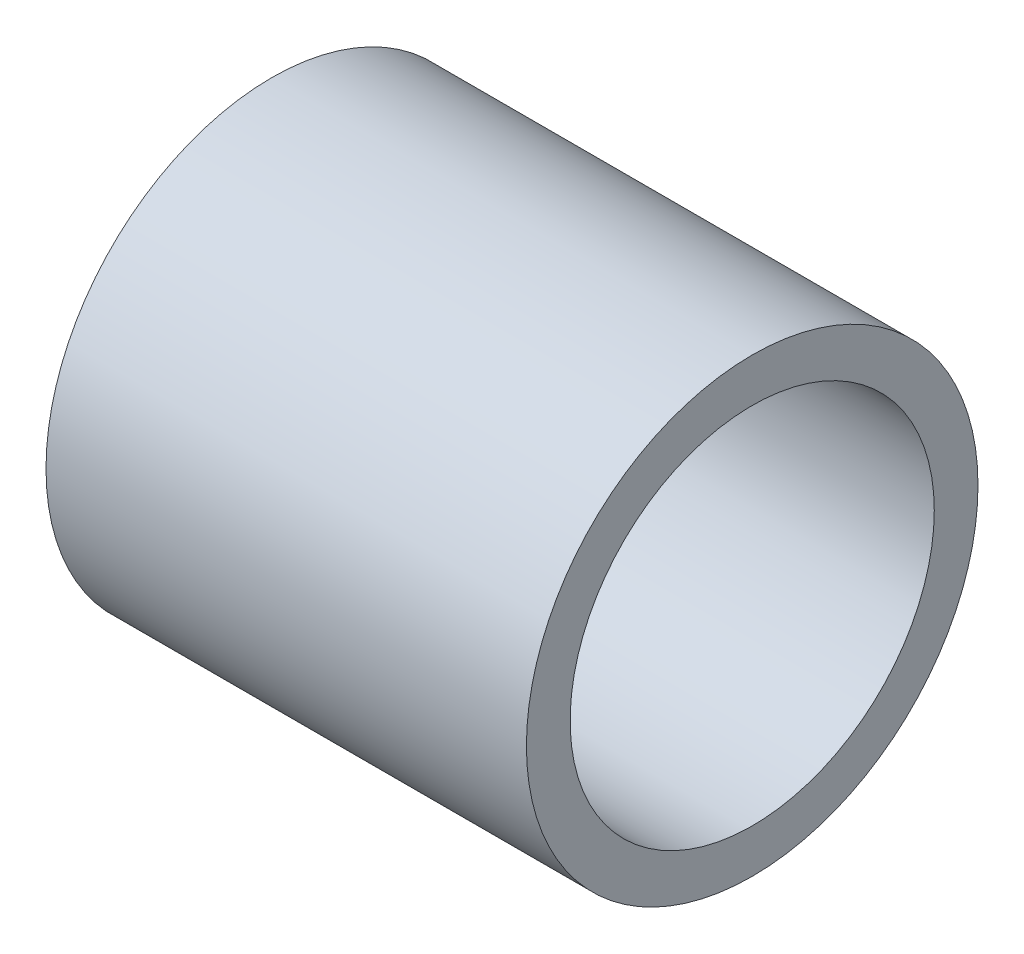
ISO-10303-21;
HEADER;
FILE_DESCRIPTION(('STEP AP214'),'2;1');
FILE_NAME('part.step','',(''),(''),'','','');
FILE_SCHEMA(('AUTOMOTIVE_DESIGN { 1 0 10303 214 1 1 1 1 }'));
ENDSEC;
DATA;
#1=APPLICATION_CONTEXT('core data for automotive mechanical design processes');
#2=APPLICATION_PROTOCOL_DEFINITION('international standard','automotive_design',2000,#1);
#3=PRODUCT_CONTEXT('',#1,'mechanical');
#4=PRODUCT('Part','Part','',(#3));
#5=PRODUCT_RELATED_PRODUCT_CATEGORY('part','',(#4));
#6=PRODUCT_DEFINITION_FORMATION('','',#4);
#7=PRODUCT_DEFINITION_CONTEXT('part definition',#1,'design');
#8=PRODUCT_DEFINITION('design','',#6,#7);
#9=PRODUCT_DEFINITION_SHAPE('','',#8);
#10=(LENGTH_UNIT() NAMED_UNIT(*) SI_UNIT(.MILLI.,.METRE.));
#11=(NAMED_UNIT(*) PLANE_ANGLE_UNIT() SI_UNIT($,.RADIAN.));
#12=(NAMED_UNIT(*) SI_UNIT($,.STERADIAN.) SOLID_ANGLE_UNIT());
#13=UNCERTAINTY_MEASURE_WITH_UNIT(LENGTH_MEASURE(1.E-05),#10,'distance_accuracy_value','');
#14=(GEOMETRIC_REPRESENTATION_CONTEXT(3) GLOBAL_UNCERTAINTY_ASSIGNED_CONTEXT((#13)) GLOBAL_UNIT_ASSIGNED_CONTEXT((#10,
#11,#12)) REPRESENTATION_CONTEXT('',''));
#15=CARTESIAN_POINT('',(0.,0.,0.));
#16=DIRECTION('',(0.,0.,1.));
#17=DIRECTION('',(1.,0.,0.));
#18=AXIS2_PLACEMENT_3D('',#15,#16,#17);
#19=CARTESIAN_POINT('',(6.35,0.,0.));
#20=DIRECTION('',(1.,0.,0.));
#21=DIRECTION('',(0.,0.,-1.));
#22=AXIS2_PLACEMENT_3D('',#19,#20,#21);
#23=PLANE('',#22);
#24=CARTESIAN_POINT('',(6.35,0.,0.));
#25=DIRECTION('',(1.,0.,0.));
#26=DIRECTION('',(0.,0.,-1.));
#27=AXIS2_PLACEMENT_3D('',#24,#25,#26);
#28=CIRCLE('',#27,5.969);
#29=CARTESIAN_POINT('',(6.35,0.,-5.969));
#30=VERTEX_POINT('',#29);
#31=EDGE_CURVE('E10',#30,#30,#28,.T.);
#32=ORIENTED_EDGE('',*,*,#31,.T.);
#33=EDGE_LOOP('',(#32));
#34=FACE_BOUND('',#33,.T.);
#35=CARTESIAN_POINT('',(6.35,0.,0.));
#36=DIRECTION('',(1.,0.,0.));
#37=DIRECTION('',(0.,0.,-1.));
#38=AXIS2_PLACEMENT_3D('',#35,#36,#37);
#39=CIRCLE('',#38,4.8133);
#40=CARTESIAN_POINT('',(6.35,0.,-4.8133));
#41=VERTEX_POINT('',#40);
#42=EDGE_CURVE('E37',#41,#41,#39,.T.);
#43=ORIENTED_EDGE('',*,*,#42,.F.);
#44=EDGE_LOOP('',(#43));
#45=FACE_BOUND('',#44,.T.);
#46=ADVANCED_FACE('F30',(#34,#45),#23,.T.);
#47=CARTESIAN_POINT('',(6.35,0.,0.));
#48=DIRECTION('',(-1.,0.,0.));
#49=DIRECTION('',(0.,0.,1.));
#50=AXIS2_PLACEMENT_3D('',#47,#48,#49);
#51=CYLINDRICAL_SURFACE('',#50,5.969);
#52=ORIENTED_EDGE('',*,*,#31,.F.);
#53=EDGE_LOOP('',(#52));
#54=FACE_BOUND('',#53,.T.);
#55=CARTESIAN_POINT('',(-6.35,0.,0.));
#56=DIRECTION('',(1.,0.,0.));
#57=DIRECTION('',(0.,0.,-1.));
#58=AXIS2_PLACEMENT_3D('',#55,#56,#57);
#59=CIRCLE('',#58,5.969);
#60=CARTESIAN_POINT('',(-6.35,0.,-5.969));
#61=VERTEX_POINT('',#60);
#62=EDGE_CURVE('E41',#61,#61,#59,.T.);
#63=ORIENTED_EDGE('',*,*,#62,.T.);
#64=EDGE_LOOP('',(#63));
#65=FACE_BOUND('',#64,.T.);
#66=ADVANCED_FACE('F32',(#54,#65),#51,.T.);
#67=CARTESIAN_POINT('',(6.35,0.,0.));
#68=DIRECTION('',(-1.,0.,0.));
#69=DIRECTION('',(0.,0.,1.));
#70=AXIS2_PLACEMENT_3D('',#67,#68,#69);
#71=CYLINDRICAL_SURFACE('',#70,4.8133);
#72=ORIENTED_EDGE('',*,*,#42,.T.);
#73=EDGE_LOOP('',(#72));
#74=FACE_BOUND('',#73,.T.);
#75=CARTESIAN_POINT('',(-6.35,0.,0.));
#76=DIRECTION('',(1.,0.,0.));
#77=DIRECTION('',(0.,0.,-1.));
#78=AXIS2_PLACEMENT_3D('',#75,#76,#77);
#79=CIRCLE('',#78,4.8133);
#80=CARTESIAN_POINT('',(-6.35,0.,-4.8133));
#81=VERTEX_POINT('',#80);
#82=EDGE_CURVE('E45',#81,#81,#79,.T.);
#83=ORIENTED_EDGE('',*,*,#82,.F.);
#84=EDGE_LOOP('',(#83));
#85=FACE_BOUND('',#84,.T.);
#86=ADVANCED_FACE('F54',(#74,#85),#71,.F.);
#87=CARTESIAN_POINT('',(-6.35,0.,0.));
#88=DIRECTION('',(1.,0.,0.));
#89=DIRECTION('',(0.,0.,-1.));
#90=AXIS2_PLACEMENT_3D('',#87,#88,#89);
#91=PLANE('',#90);
#92=ORIENTED_EDGE('',*,*,#82,.T.);
#93=EDGE_LOOP('',(#92));
#94=FACE_BOUND('',#93,.T.);
#95=ORIENTED_EDGE('',*,*,#62,.F.);
#96=EDGE_LOOP('',(#95));
#97=FACE_BOUND('',#96,.T.);
#98=ADVANCED_FACE('F51',(#94,#97),#91,.F.);
#99=CLOSED_SHELL('',(#46,#66,#86,#98));
#100=MANIFOLD_SOLID_BREP('B2',#99);
#101=ADVANCED_BREP_SHAPE_REPRESENTATION('',(#18,#100),#14);
#102=SHAPE_DEFINITION_REPRESENTATION(#9,#101);
ENDSEC;
END-ISO-10303-21;
